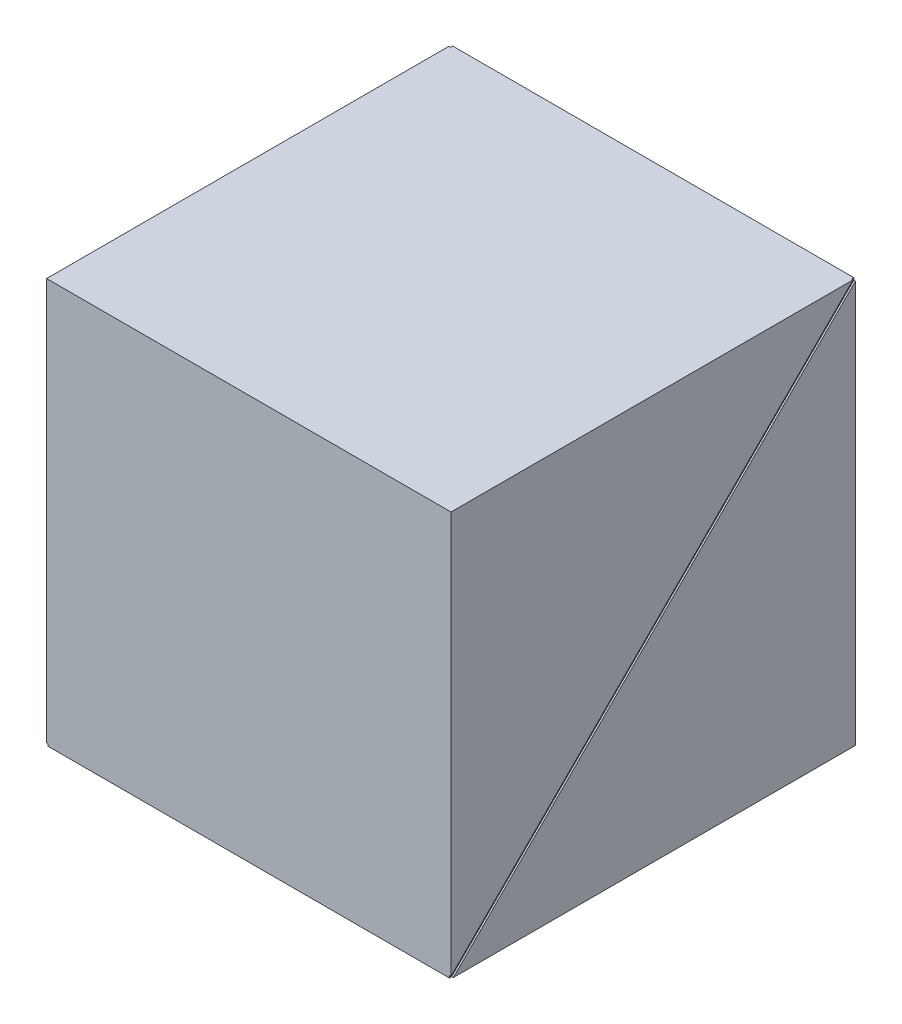
ISO-10303-21;
HEADER;
FILE_DESCRIPTION(('STEP AP214'),'2;1');
FILE_NAME('part.step','',(''),(''),'','','');
FILE_SCHEMA(('AUTOMOTIVE_DESIGN { 1 0 10303 214 1 1 1 1 }'));
ENDSEC;
DATA;
#1=APPLICATION_CONTEXT('core data for automotive mechanical design processes');
#2=APPLICATION_PROTOCOL_DEFINITION('international standard','automotive_design',2000,#1);
#3=PRODUCT_CONTEXT('',#1,'mechanical');
#4=PRODUCT('Part','Part','',(#3));
#5=PRODUCT_RELATED_PRODUCT_CATEGORY('part','',(#4));
#6=PRODUCT_DEFINITION_FORMATION('','',#4);
#7=PRODUCT_DEFINITION_CONTEXT('part definition',#1,'design');
#8=PRODUCT_DEFINITION('design','',#6,#7);
#9=PRODUCT_DEFINITION_SHAPE('','',#8);
#10=(LENGTH_UNIT() NAMED_UNIT(*) SI_UNIT(.MILLI.,.METRE.));
#11=(NAMED_UNIT(*) PLANE_ANGLE_UNIT() SI_UNIT($,.RADIAN.));
#12=(NAMED_UNIT(*) SI_UNIT($,.STERADIAN.) SOLID_ANGLE_UNIT());
#13=UNCERTAINTY_MEASURE_WITH_UNIT(LENGTH_MEASURE(1.E-05),#10,'distance_accuracy_value','');
#14=(GEOMETRIC_REPRESENTATION_CONTEXT(3) GLOBAL_UNCERTAINTY_ASSIGNED_CONTEXT((#13)) GLOBAL_UNIT_ASSIGNED_CONTEXT((#10,
#11,#12)) REPRESENTATION_CONTEXT('',''));
#15=CARTESIAN_POINT('',(0.,0.,0.));
#16=DIRECTION('',(0.,0.,1.));
#17=DIRECTION('',(1.,0.,0.));
#18=AXIS2_PLACEMENT_3D('',#15,#16,#17);
#19=CARTESIAN_POINT('',(-12.5,25.,12.5));
#20=DIRECTION('',(1.,0.,0.));
#21=DIRECTION('',(0.,0.,-1.));
#22=AXIS2_PLACEMENT_3D('',#19,#20,#21);
#23=PLANE('',#22);
#24=DIRECTION('',(0.,0.,1.));
#25=VECTOR('',#24,1.);
#26=CARTESIAN_POINT('',(-12.5,25.,12.5));
#27=LINE('',#26,#25);
#28=CARTESIAN_POINT('',(-12.5,25.,-12.3585786437627));
#29=VERTEX_POINT('',#28);
#30=CARTESIAN_POINT('',(-12.5,25.,12.5));
#31=VERTEX_POINT('',#30);
#32=EDGE_CURVE('E217',#29,#31,#27,.T.);
#33=ORIENTED_EDGE('',*,*,#32,.F.);
#34=DIRECTION('',(0.,0.707106781186547,-0.707106781186547));
#35=VECTOR('',#34,1.);
#36=CARTESIAN_POINT('',(-12.5,0.0707106781186513,12.5707106781187));
#37=LINE('',#36,#35);
#38=CARTESIAN_POINT('',(-12.5,0.141421356237309,12.5));
#39=VERTEX_POINT('',#38);
#40=EDGE_CURVE('E145',#39,#29,#37,.T.);
#41=ORIENTED_EDGE('',*,*,#40,.F.);
#42=DIRECTION('',(0.,-1.,0.));
#43=VECTOR('',#42,1.);
#44=CARTESIAN_POINT('',(-12.5,25.,12.5));
#45=LINE('',#44,#43);
#46=EDGE_CURVE('E151',#31,#39,#45,.T.);
#47=ORIENTED_EDGE('',*,*,#46,.F.);
#48=EDGE_LOOP('',(#33,#41,#47));
#49=FACE_BOUND('',#48,.T.);
#50=ADVANCED_FACE('F37',(#49),#23,.F.);
#51=CARTESIAN_POINT('',(12.5,25.,12.5));
#52=DIRECTION('',(-1.,0.,0.));
#53=DIRECTION('',(0.,0.,1.));
#54=AXIS2_PLACEMENT_3D('',#51,#52,#53);
#55=PLANE('',#54);
#56=DIRECTION('',(0.,-1.,0.));
#57=VECTOR('',#56,1.);
#58=CARTESIAN_POINT('',(12.5,25.,-12.5));
#59=LINE('',#58,#57);
#60=CARTESIAN_POINT('',(12.5,24.8585786437627,-12.5));
#61=VERTEX_POINT('',#60);
#62=CARTESIAN_POINT('',(12.5,0.,-12.5));
#63=VERTEX_POINT('',#62);
#64=EDGE_CURVE('E150',#61,#63,#59,.T.);
#65=ORIENTED_EDGE('',*,*,#64,.F.);
#66=DIRECTION('',(0.,0.707106781186547,-0.707106781186547));
#67=VECTOR('',#66,1.);
#68=CARTESIAN_POINT('',(12.5,24.9292893218813,-12.5707106781187));
#69=LINE('',#68,#67);
#70=CARTESIAN_POINT('',(12.5,0.,12.3585786437627));
#71=VERTEX_POINT('',#70);
#72=EDGE_CURVE('E191',#71,#61,#69,.T.);
#73=ORIENTED_EDGE('',*,*,#72,.F.);
#74=DIRECTION('',(0.,0.,-1.));
#75=VECTOR('',#74,1.);
#76=CARTESIAN_POINT('',(12.5,0.,12.5));
#77=LINE('',#76,#75);
#78=EDGE_CURVE('E210',#71,#63,#77,.T.);
#79=ORIENTED_EDGE('',*,*,#78,.T.);
#80=EDGE_LOOP('',(#65,#73,#79));
#81=FACE_BOUND('',#80,.T.);
#82=ADVANCED_FACE('F258',(#81),#55,.F.);
#83=DIRECTION('',(0.,-1.,0.));
#84=VECTOR('',#83,1.);
#85=CARTESIAN_POINT('',(12.5,25.,12.5));
#86=LINE('',#85,#84);
#87=CARTESIAN_POINT('',(12.5,25.,12.5));
#88=VERTEX_POINT('',#87);
#89=CARTESIAN_POINT('',(12.5,0.141421356237303,12.5));
#90=VERTEX_POINT('',#89);
#91=EDGE_CURVE('E156',#88,#90,#86,.T.);
#92=ORIENTED_EDGE('',*,*,#91,.T.);
#93=DIRECTION('',(0.,-0.707106781186547,0.707106781186547));
#94=VECTOR('',#93,1.);
#95=CARTESIAN_POINT('',(12.5,25.0707106781187,-12.4292893218813));
#96=LINE('',#95,#94);
#97=CARTESIAN_POINT('',(12.5,25.,-12.3585786437627));
#98=VERTEX_POINT('',#97);
#99=EDGE_CURVE('E186',#98,#90,#96,.T.);
#100=ORIENTED_EDGE('',*,*,#99,.F.);
#101=DIRECTION('',(0.,0.,-1.));
#102=VECTOR('',#101,1.);
#103=CARTESIAN_POINT('',(12.5,25.,12.5));
#104=LINE('',#103,#102);
#105=EDGE_CURVE('E211',#88,#98,#104,.T.);
#106=ORIENTED_EDGE('',*,*,#105,.F.);
#107=EDGE_LOOP('',(#92,#100,#106));
#108=FACE_BOUND('',#107,.T.);
#109=ADVANCED_FACE('F39',(#108),#55,.F.);
#110=CARTESIAN_POINT('',(-12.5,25.,-12.5));
#111=DIRECTION('',(0.,0.,1.));
#112=DIRECTION('',(1.,0.,0.));
#113=AXIS2_PLACEMENT_3D('',#110,#111,#112);
#114=PLANE('',#113);
#115=DIRECTION('',(0.,-1.,0.));
#116=VECTOR('',#115,1.);
#117=CARTESIAN_POINT('',(-12.5,25.,-12.5));
#118=LINE('',#117,#116);
#119=CARTESIAN_POINT('',(-12.5,24.8585786437627,-12.5));
#120=VERTEX_POINT('',#119);
#121=CARTESIAN_POINT('',(-12.5,0.,-12.5));
#122=VERTEX_POINT('',#121);
#123=EDGE_CURVE('E141',#120,#122,#118,.T.);
#124=ORIENTED_EDGE('',*,*,#123,.F.);
#125=DIRECTION('',(1.,0.,0.));
#126=VECTOR('',#125,1.);
#127=CARTESIAN_POINT('',(-12.5,24.8585786437627,-12.5));
#128=LINE('',#127,#126);
#129=CARTESIAN_POINT('',(-12.4,24.8585786437627,-12.5));
#130=VERTEX_POINT('',#129);
#131=EDGE_CURVE('E127',#120,#130,#128,.T.);
#132=ORIENTED_EDGE('',*,*,#131,.T.);
#133=DIRECTION('',(0.,-1.,0.));
#134=VECTOR('',#133,1.);
#135=CARTESIAN_POINT('',(-12.4,25.,-12.5));
#136=LINE('',#135,#134);
#137=CARTESIAN_POINT('',(-12.4,25.,-12.5));
#138=VERTEX_POINT('',#137);
#139=EDGE_CURVE('E136',#138,#130,#136,.T.);
#140=ORIENTED_EDGE('',*,*,#139,.F.);
#141=DIRECTION('',(-1.,0.,0.));
#142=VECTOR('',#141,1.);
#143=CARTESIAN_POINT('',(-12.5,25.,-12.5));
#144=LINE('',#143,#142);
#145=CARTESIAN_POINT('',(12.4,25.,-12.5));
#146=VERTEX_POINT('',#145);
#147=EDGE_CURVE('E214',#146,#138,#144,.T.);
#148=ORIENTED_EDGE('',*,*,#147,.F.);
#149=DIRECTION('',(0.,-1.,0.));
#150=VECTOR('',#149,1.);
#151=CARTESIAN_POINT('',(12.4,25.,-12.5));
#152=LINE('',#151,#150);
#153=CARTESIAN_POINT('',(12.4,24.8585786437627,-12.5));
#154=VERTEX_POINT('',#153);
#155=EDGE_CURVE('E201',#146,#154,#152,.T.);
#156=ORIENTED_EDGE('',*,*,#155,.T.);
#157=DIRECTION('',(1.,0.,0.));
#158=VECTOR('',#157,1.);
#159=CARTESIAN_POINT('',(-12.5,24.8585786437627,-12.5));
#160=LINE('',#159,#158);
#161=EDGE_CURVE('E204',#154,#61,#160,.T.);
#162=ORIENTED_EDGE('',*,*,#161,.T.);
#163=ORIENTED_EDGE('',*,*,#64,.T.);
#164=DIRECTION('',(-1.,0.,0.));
#165=VECTOR('',#164,1.);
#166=CARTESIAN_POINT('',(-12.5,0.,-12.5));
#167=LINE('',#166,#165);
#168=EDGE_CURVE('E149',#63,#122,#167,.T.);
#169=ORIENTED_EDGE('',*,*,#168,.T.);
#170=EDGE_LOOP('',(#124,#132,#140,#148,#156,#162,#163,#169));
#171=FACE_BOUND('',#170,.T.);
#172=ADVANCED_FACE('F147',(#171),#114,.F.);
#173=DIRECTION('',(0.,0.,1.));
#174=VECTOR('',#173,1.);
#175=CARTESIAN_POINT('',(-12.5,0.,12.5));
#176=LINE('',#175,#174);
#177=CARTESIAN_POINT('',(-12.5,0.,12.3585786437627));
#178=VERTEX_POINT('',#177);
#179=EDGE_CURVE('E144',#122,#178,#176,.T.);
#180=ORIENTED_EDGE('',*,*,#179,.T.);
#181=DIRECTION('',(0.,-0.707106781186547,0.707106781186547));
#182=VECTOR('',#181,1.);
#183=CARTESIAN_POINT('',(-12.5,24.9292893218813,-12.5707106781187));
#184=LINE('',#183,#182);
#185=EDGE_CURVE('E130',#120,#178,#184,.T.);
#186=ORIENTED_EDGE('',*,*,#185,.F.);
#187=ORIENTED_EDGE('',*,*,#123,.T.);
#188=EDGE_LOOP('',(#180,#186,#187));
#189=FACE_BOUND('',#188,.T.);
#190=ADVANCED_FACE('F140',(#189),#23,.F.);
#191=CARTESIAN_POINT('',(-12.5,25.,12.5));
#192=DIRECTION('',(0.,0.,-1.));
#193=DIRECTION('',(-1.,0.,0.));
#194=AXIS2_PLACEMENT_3D('',#191,#192,#193);
#195=PLANE('',#194);
#196=ORIENTED_EDGE('',*,*,#46,.T.);
#197=DIRECTION('',(1.,0.,0.));
#198=VECTOR('',#197,1.);
#199=CARTESIAN_POINT('',(-12.5,0.141421356237306,12.5));
#200=LINE('',#199,#198);
#201=CARTESIAN_POINT('',(-12.4,0.141421356237309,12.5));
#202=VERTEX_POINT('',#201);
#203=EDGE_CURVE('E135',#39,#202,#200,.T.);
#204=ORIENTED_EDGE('',*,*,#203,.T.);
#205=DIRECTION('',(0.,1.,0.));
#206=VECTOR('',#205,1.);
#207=CARTESIAN_POINT('',(-12.4,25.,12.5));
#208=LINE('',#207,#206);
#209=CARTESIAN_POINT('',(-12.4,0.,12.5));
#210=VERTEX_POINT('',#209);
#211=EDGE_CURVE('E173',#210,#202,#208,.T.);
#212=ORIENTED_EDGE('',*,*,#211,.F.);
#213=DIRECTION('',(1.,0.,0.));
#214=VECTOR('',#213,1.);
#215=CARTESIAN_POINT('',(-12.5,0.,12.5));
#216=LINE('',#215,#214);
#217=CARTESIAN_POINT('',(12.4,0.,12.5));
#218=VERTEX_POINT('',#217);
#219=EDGE_CURVE('E60',#210,#218,#216,.T.);
#220=ORIENTED_EDGE('',*,*,#219,.T.);
#221=DIRECTION('',(0.,1.,0.));
#222=VECTOR('',#221,1.);
#223=CARTESIAN_POINT('',(12.4,25.,12.5));
#224=LINE('',#223,#222);
#225=CARTESIAN_POINT('',(12.4,0.141421356237303,12.5));
#226=VERTEX_POINT('',#225);
#227=EDGE_CURVE('E194',#218,#226,#224,.T.);
#228=ORIENTED_EDGE('',*,*,#227,.T.);
#229=DIRECTION('',(1.,0.,0.));
#230=VECTOR('',#229,1.);
#231=CARTESIAN_POINT('',(-12.5,0.141421356237306,12.5));
#232=LINE('',#231,#230);
#233=EDGE_CURVE('E207',#226,#90,#232,.T.);
#234=ORIENTED_EDGE('',*,*,#233,.T.);
#235=ORIENTED_EDGE('',*,*,#91,.F.);
#236=DIRECTION('',(1.,0.,0.));
#237=VECTOR('',#236,1.);
#238=CARTESIAN_POINT('',(-12.5,25.,12.5));
#239=LINE('',#238,#237);
#240=EDGE_CURVE('E219',#31,#88,#239,.T.);
#241=ORIENTED_EDGE('',*,*,#240,.F.);
#242=EDGE_LOOP('',(#196,#204,#212,#220,#228,#234,#235,#241));
#243=FACE_BOUND('',#242,.T.);
#244=ADVANCED_FACE('F176',(#243),#195,.F.);
#245=CARTESIAN_POINT('',(0.,25.,0.));
#246=DIRECTION('',(0.,-1.,0.));
#247=DIRECTION('',(0.,0.,-1.));
#248=AXIS2_PLACEMENT_3D('',#245,#246,#247);
#249=PLANE('',#248);
#250=DIRECTION('',(0.,0.,-1.));
#251=VECTOR('',#250,1.);
#252=CARTESIAN_POINT('',(-12.4,25.,0.));
#253=LINE('',#252,#251);
#254=CARTESIAN_POINT('',(-12.4,25.,-12.3585786437627));
#255=VERTEX_POINT('',#254);
#256=EDGE_CURVE('E177',#255,#138,#253,.T.);
#257=ORIENTED_EDGE('',*,*,#256,.F.);
#258=DIRECTION('',(-1.,0.,0.));
#259=VECTOR('',#258,1.);
#260=CARTESIAN_POINT('',(0.,25.,-12.3585786437627));
#261=LINE('',#260,#259);
#262=EDGE_CURVE('E11',#255,#29,#261,.T.);
#263=ORIENTED_EDGE('',*,*,#262,.T.);
#264=ORIENTED_EDGE('',*,*,#32,.T.);
#265=ORIENTED_EDGE('',*,*,#240,.T.);
#266=ORIENTED_EDGE('',*,*,#105,.T.);
#267=DIRECTION('',(-1.,0.,0.));
#268=VECTOR('',#267,1.);
#269=CARTESIAN_POINT('',(0.,25.,-12.3585786437627));
#270=LINE('',#269,#268);
#271=CARTESIAN_POINT('',(12.4,25.,-12.3585786437627));
#272=VERTEX_POINT('',#271);
#273=EDGE_CURVE('E163',#98,#272,#270,.T.);
#274=ORIENTED_EDGE('',*,*,#273,.T.);
#275=DIRECTION('',(0.,0.,-1.));
#276=VECTOR('',#275,1.);
#277=CARTESIAN_POINT('',(12.4,25.,0.));
#278=LINE('',#277,#276);
#279=EDGE_CURVE('E198',#272,#146,#278,.T.);
#280=ORIENTED_EDGE('',*,*,#279,.T.);
#281=ORIENTED_EDGE('',*,*,#147,.T.);
#282=EDGE_LOOP('',(#257,#263,#264,#265,#266,#274,#280,#281));
#283=FACE_BOUND('',#282,.T.);
#284=ADVANCED_FACE('F239',(#283),#249,.F.);
#285=CARTESIAN_POINT('',(0.,0.,0.));
#286=DIRECTION('',(0.,-1.,0.));
#287=DIRECTION('',(0.,0.,-1.));
#288=AXIS2_PLACEMENT_3D('',#285,#286,#287);
#289=PLANE('',#288);
#290=DIRECTION('',(1.,0.,0.));
#291=VECTOR('',#290,1.);
#292=CARTESIAN_POINT('',(0.,0.,12.3585786437627));
#293=LINE('',#292,#291);
#294=CARTESIAN_POINT('',(-12.4,0.,12.3585786437627));
#295=VERTEX_POINT('',#294);
#296=EDGE_CURVE('E45',#178,#295,#293,.T.);
#297=ORIENTED_EDGE('',*,*,#296,.F.);
#298=ORIENTED_EDGE('',*,*,#179,.F.);
#299=ORIENTED_EDGE('',*,*,#168,.F.);
#300=ORIENTED_EDGE('',*,*,#78,.F.);
#301=DIRECTION('',(1.,0.,0.));
#302=VECTOR('',#301,1.);
#303=CARTESIAN_POINT('',(0.,0.,12.3585786437627));
#304=LINE('',#303,#302);
#305=CARTESIAN_POINT('',(12.4,0.,12.3585786437627));
#306=VERTEX_POINT('',#305);
#307=EDGE_CURVE('E161',#306,#71,#304,.T.);
#308=ORIENTED_EDGE('',*,*,#307,.F.);
#309=DIRECTION('',(0.,0.,-1.));
#310=VECTOR('',#309,1.);
#311=CARTESIAN_POINT('',(12.4,0.,0.));
#312=LINE('',#311,#310);
#313=EDGE_CURVE('E153',#218,#306,#312,.T.);
#314=ORIENTED_EDGE('',*,*,#313,.F.);
#315=ORIENTED_EDGE('',*,*,#219,.F.);
#316=DIRECTION('',(0.,0.,-1.));
#317=VECTOR('',#316,1.);
#318=CARTESIAN_POINT('',(-12.4,0.,0.));
#319=LINE('',#318,#317);
#320=EDGE_CURVE('E166',#210,#295,#319,.T.);
#321=ORIENTED_EDGE('',*,*,#320,.T.);
#322=EDGE_LOOP('',(#297,#298,#299,#300,#308,#314,#315,#321));
#323=FACE_BOUND('',#322,.T.);
#324=ADVANCED_FACE('F169',(#323),#289,.T.);
#325=CARTESIAN_POINT('',(12.4,25.0707106781187,-12.4292893218813));
#326=DIRECTION('',(0.,0.707106781186548,0.707106781186548));
#327=DIRECTION('',(0.,-0.707106781186548,0.707106781186548));
#328=AXIS2_PLACEMENT_3D('',#325,#326,#327);
#329=PLANE('',#328);
#330=DIRECTION('',(0.,-0.707106781186547,0.707106781186547));
#331=VECTOR('',#330,1.);
#332=CARTESIAN_POINT('',(12.4,25.0707106781187,-12.4292893218813));
#333=LINE('',#332,#331);
#334=EDGE_CURVE('E187',#272,#226,#333,.T.);
#335=ORIENTED_EDGE('',*,*,#334,.F.);
#336=ORIENTED_EDGE('',*,*,#273,.F.);
#337=ORIENTED_EDGE('',*,*,#99,.T.);
#338=ORIENTED_EDGE('',*,*,#233,.F.);
#339=EDGE_LOOP('',(#335,#336,#337,#338));
#340=FACE_BOUND('',#339,.T.);
#341=ADVANCED_FACE('F233',(#340),#329,.F.);
#342=CARTESIAN_POINT('',(12.4,24.9292893218813,-12.5707106781187));
#343=DIRECTION('',(0.,-0.707106781186548,-0.707106781186548));
#344=DIRECTION('',(0.,0.707106781186548,-0.707106781186548));
#345=AXIS2_PLACEMENT_3D('',#342,#343,#344);
#346=PLANE('',#345);
#347=DIRECTION('',(0.,0.707106781186547,-0.707106781186547));
#348=VECTOR('',#347,1.);
#349=CARTESIAN_POINT('',(12.4,24.9292893218813,-12.5707106781187));
#350=LINE('',#349,#348);
#351=EDGE_CURVE('E190',#306,#154,#350,.T.);
#352=ORIENTED_EDGE('',*,*,#351,.F.);
#353=ORIENTED_EDGE('',*,*,#307,.T.);
#354=ORIENTED_EDGE('',*,*,#72,.T.);
#355=ORIENTED_EDGE('',*,*,#161,.F.);
#356=EDGE_LOOP('',(#352,#353,#354,#355));
#357=FACE_BOUND('',#356,.T.);
#358=ADVANCED_FACE('F254',(#357),#346,.F.);
#359=CARTESIAN_POINT('',(12.4,0.,0.));
#360=DIRECTION('',(-1.,0.,0.));
#361=DIRECTION('',(0.,0.,1.));
#362=AXIS2_PLACEMENT_3D('',#359,#360,#361);
#363=PLANE('',#362);
#364=ORIENTED_EDGE('',*,*,#279,.F.);
#365=ORIENTED_EDGE('',*,*,#334,.T.);
#366=ORIENTED_EDGE('',*,*,#227,.F.);
#367=ORIENTED_EDGE('',*,*,#313,.T.);
#368=ORIENTED_EDGE('',*,*,#351,.T.);
#369=ORIENTED_EDGE('',*,*,#155,.F.);
#370=EDGE_LOOP('',(#364,#365,#366,#367,#368,#369));
#371=FACE_BOUND('',#370,.T.);
#372=ADVANCED_FACE('F235',(#371),#363,.F.);
#373=CARTESIAN_POINT('',(-12.4,0.0707106781186513,12.5707106781187));
#374=DIRECTION('',(0.,0.707106781186548,0.707106781186548));
#375=DIRECTION('',(0.,-0.707106781186548,0.707106781186548));
#376=AXIS2_PLACEMENT_3D('',#373,#374,#375);
#377=PLANE('',#376);
#378=ORIENTED_EDGE('',*,*,#40,.T.);
#379=ORIENTED_EDGE('',*,*,#262,.F.);
#380=DIRECTION('',(0.,0.707106781186547,-0.707106781186547));
#381=VECTOR('',#380,1.);
#382=CARTESIAN_POINT('',(-12.4,0.0707106781186513,12.5707106781187));
#383=LINE('',#382,#381);
#384=EDGE_CURVE('E178',#202,#255,#383,.T.);
#385=ORIENTED_EDGE('',*,*,#384,.F.);
#386=ORIENTED_EDGE('',*,*,#203,.F.);
#387=EDGE_LOOP('',(#378,#379,#385,#386));
#388=FACE_BOUND('',#387,.T.);
#389=ADVANCED_FACE('F246',(#388),#377,.F.);
#390=CARTESIAN_POINT('',(-12.4,24.9292893218813,-12.5707106781187));
#391=DIRECTION('',(0.,-0.707106781186548,-0.707106781186548));
#392=DIRECTION('',(0.,0.707106781186548,-0.707106781186548));
#393=AXIS2_PLACEMENT_3D('',#390,#391,#392);
#394=PLANE('',#393);
#395=ORIENTED_EDGE('',*,*,#185,.T.);
#396=ORIENTED_EDGE('',*,*,#296,.T.);
#397=DIRECTION('',(0.,-0.707106781186547,0.707106781186547));
#398=VECTOR('',#397,1.);
#399=CARTESIAN_POINT('',(-12.4,24.9292893218813,-12.5707106781187));
#400=LINE('',#399,#398);
#401=EDGE_CURVE('E52',#130,#295,#400,.T.);
#402=ORIENTED_EDGE('',*,*,#401,.F.);
#403=ORIENTED_EDGE('',*,*,#131,.F.);
#404=EDGE_LOOP('',(#395,#396,#402,#403));
#405=FACE_BOUND('',#404,.T.);
#406=ADVANCED_FACE('F129',(#405),#394,.F.);
#407=CARTESIAN_POINT('',(-12.4,0.,0.));
#408=DIRECTION('',(-1.,0.,0.));
#409=DIRECTION('',(0.,0.,1.));
#410=AXIS2_PLACEMENT_3D('',#407,#408,#409);
#411=PLANE('',#410);
#412=ORIENTED_EDGE('',*,*,#139,.T.);
#413=ORIENTED_EDGE('',*,*,#401,.T.);
#414=ORIENTED_EDGE('',*,*,#320,.F.);
#415=ORIENTED_EDGE('',*,*,#211,.T.);
#416=ORIENTED_EDGE('',*,*,#384,.T.);
#417=ORIENTED_EDGE('',*,*,#256,.T.);
#418=EDGE_LOOP('',(#412,#413,#414,#415,#416,#417));
#419=FACE_BOUND('',#418,.T.);
#420=ADVANCED_FACE('F171',(#419),#411,.T.);
#421=CLOSED_SHELL('',(#50,#82,#109,#172,#190,#244,#284,#324,#341,#358,#372,#389,#406,#420));
#422=MANIFOLD_SOLID_BREP('B2',#421);
#423=ADVANCED_BREP_SHAPE_REPRESENTATION('',(#18,#422),#14);
#424=SHAPE_DEFINITION_REPRESENTATION(#9,#423);
ENDSEC;
END-ISO-10303-21;
